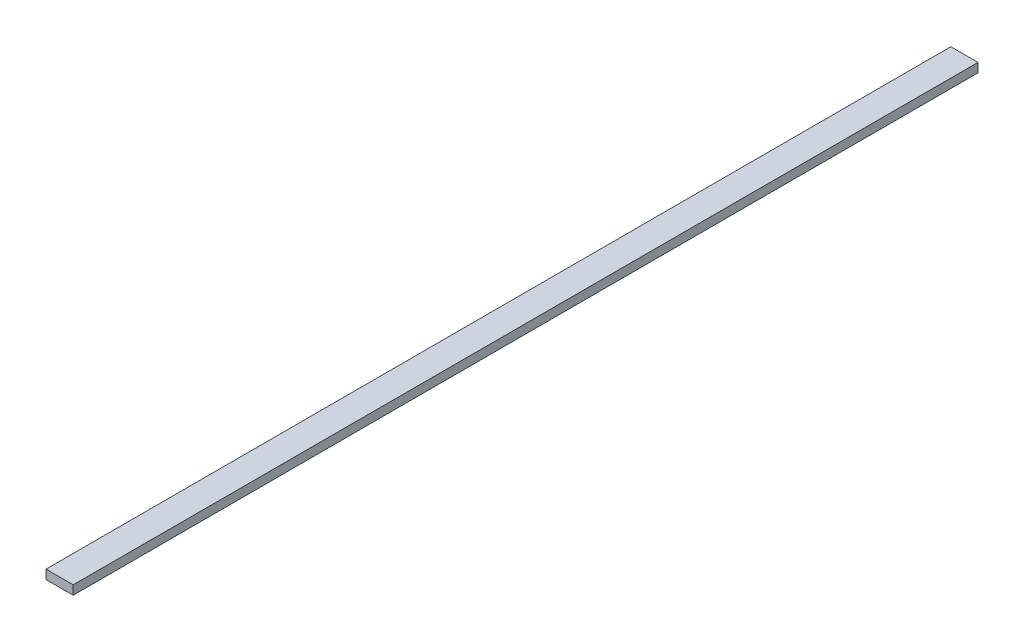
ISO-10303-21;
HEADER;
FILE_DESCRIPTION(('STEP AP214'),'2;1');
FILE_NAME('part.step','',(''),(''),'','','');
FILE_SCHEMA(('AUTOMOTIVE_DESIGN { 1 0 10303 214 1 1 1 1 }'));
ENDSEC;
DATA;
#1=APPLICATION_CONTEXT('core data for automotive mechanical design processes');
#2=APPLICATION_PROTOCOL_DEFINITION('international standard','automotive_design',2000,#1);
#3=PRODUCT_CONTEXT('',#1,'mechanical');
#4=PRODUCT('Part','Part','',(#3));
#5=PRODUCT_RELATED_PRODUCT_CATEGORY('part','',(#4));
#6=PRODUCT_DEFINITION_FORMATION('','',#4);
#7=PRODUCT_DEFINITION_CONTEXT('part definition',#1,'design');
#8=PRODUCT_DEFINITION('design','',#6,#7);
#9=PRODUCT_DEFINITION_SHAPE('','',#8);
#10=(LENGTH_UNIT() NAMED_UNIT(*) SI_UNIT(.MILLI.,.METRE.));
#11=(NAMED_UNIT(*) PLANE_ANGLE_UNIT() SI_UNIT($,.RADIAN.));
#12=(NAMED_UNIT(*) SI_UNIT($,.STERADIAN.) SOLID_ANGLE_UNIT());
#13=UNCERTAINTY_MEASURE_WITH_UNIT(LENGTH_MEASURE(1.E-05),#10,'distance_accuracy_value','');
#14=(GEOMETRIC_REPRESENTATION_CONTEXT(3) GLOBAL_UNCERTAINTY_ASSIGNED_CONTEXT((#13)) GLOBAL_UNIT_ASSIGNED_CONTEXT((#10,
#11,#12)) REPRESENTATION_CONTEXT('',''));
#15=CARTESIAN_POINT('',(0.,0.,0.));
#16=DIRECTION('',(0.,0.,1.));
#17=DIRECTION('',(1.,0.,0.));
#18=AXIS2_PLACEMENT_3D('',#15,#16,#17);
#19=CARTESIAN_POINT('',(-150.000000000001,100.,-5000.));
#20=DIRECTION('',(1.,0.,0.));
#21=DIRECTION('',(0.,0.,-1.));
#22=AXIS2_PLACEMENT_3D('',#19,#20,#21);
#23=PLANE('',#22);
#24=DIRECTION('',(0.,0.,1.));
#25=VECTOR('',#24,1.);
#26=CARTESIAN_POINT('',(-150.000000000001,0.,-5000.));
#27=LINE('',#26,#25);
#28=CARTESIAN_POINT('',(-150.000000000001,0.,-5000.));
#29=VERTEX_POINT('',#28);
#30=CARTESIAN_POINT('',(-150.,0.,5000.));
#31=VERTEX_POINT('',#30);
#32=EDGE_CURVE('E96',#29,#31,#27,.T.);
#33=ORIENTED_EDGE('',*,*,#32,.T.);
#34=DIRECTION('',(0.,-1.,0.));
#35=VECTOR('',#34,1.);
#36=CARTESIAN_POINT('',(-150.,100.,5000.));
#37=LINE('',#36,#35);
#38=CARTESIAN_POINT('',(-150.,100.,5000.));
#39=VERTEX_POINT('',#38);
#40=EDGE_CURVE('E11',#39,#31,#37,.T.);
#41=ORIENTED_EDGE('',*,*,#40,.F.);
#42=DIRECTION('',(0.,0.,1.));
#43=VECTOR('',#42,1.);
#44=CARTESIAN_POINT('',(-150.000000000001,100.,-5000.));
#45=LINE('',#44,#43);
#46=CARTESIAN_POINT('',(-150.000000000001,100.,-5000.));
#47=VERTEX_POINT('',#46);
#48=EDGE_CURVE('E84',#47,#39,#45,.T.);
#49=ORIENTED_EDGE('',*,*,#48,.F.);
#50=DIRECTION('',(0.,-1.,0.));
#51=VECTOR('',#50,1.);
#52=CARTESIAN_POINT('',(-150.000000000001,100.,-5000.));
#53=LINE('',#52,#51);
#54=EDGE_CURVE('E92',#47,#29,#53,.T.);
#55=ORIENTED_EDGE('',*,*,#54,.T.);
#56=EDGE_LOOP('',(#33,#41,#49,#55));
#57=FACE_BOUND('',#56,.T.);
#58=ADVANCED_FACE('F33',(#57),#23,.F.);
#59=CARTESIAN_POINT('',(-150.,100.,5000.));
#60=DIRECTION('',(0.,0.,-1.));
#61=DIRECTION('',(-1.,0.,0.));
#62=AXIS2_PLACEMENT_3D('',#59,#60,#61);
#63=PLANE('',#62);
#64=DIRECTION('',(1.,0.,0.));
#65=VECTOR('',#64,1.);
#66=CARTESIAN_POINT('',(-150.,0.,5000.));
#67=LINE('',#66,#65);
#68=CARTESIAN_POINT('',(150.,0.,5000.));
#69=VERTEX_POINT('',#68);
#70=EDGE_CURVE('E88',#31,#69,#67,.T.);
#71=ORIENTED_EDGE('',*,*,#70,.T.);
#72=DIRECTION('',(0.,-1.,0.));
#73=VECTOR('',#72,1.);
#74=CARTESIAN_POINT('',(150.,100.,5000.));
#75=LINE('',#74,#73);
#76=CARTESIAN_POINT('',(150.,100.,5000.));
#77=VERTEX_POINT('',#76);
#78=EDGE_CURVE('E41',#77,#69,#75,.T.);
#79=ORIENTED_EDGE('',*,*,#78,.F.);
#80=DIRECTION('',(1.,0.,0.));
#81=VECTOR('',#80,1.);
#82=CARTESIAN_POINT('',(-150.,100.,5000.));
#83=LINE('',#82,#81);
#84=EDGE_CURVE('E79',#39,#77,#83,.T.);
#85=ORIENTED_EDGE('',*,*,#84,.F.);
#86=ORIENTED_EDGE('',*,*,#40,.T.);
#87=EDGE_LOOP('',(#71,#79,#85,#86));
#88=FACE_BOUND('',#87,.T.);
#89=ADVANCED_FACE('F87',(#88),#63,.F.);
#90=CARTESIAN_POINT('',(149.999999999999,100.,-5000.));
#91=DIRECTION('',(-1.,0.,0.));
#92=DIRECTION('',(0.,0.,1.));
#93=AXIS2_PLACEMENT_3D('',#90,#91,#92);
#94=PLANE('',#93);
#95=DIRECTION('',(0.,0.,-1.));
#96=VECTOR('',#95,1.);
#97=CARTESIAN_POINT('',(149.999999999999,0.,-5000.));
#98=LINE('',#97,#96);
#99=CARTESIAN_POINT('',(149.999999999999,0.,-5000.));
#100=VERTEX_POINT('',#99);
#101=EDGE_CURVE('E66',#69,#100,#98,.T.);
#102=ORIENTED_EDGE('',*,*,#101,.T.);
#103=DIRECTION('',(0.,-1.,0.));
#104=VECTOR('',#103,1.);
#105=CARTESIAN_POINT('',(149.999999999999,100.,-5000.));
#106=LINE('',#105,#104);
#107=CARTESIAN_POINT('',(149.999999999999,100.,-5000.));
#108=VERTEX_POINT('',#107);
#109=EDGE_CURVE('E89',#108,#100,#106,.T.);
#110=ORIENTED_EDGE('',*,*,#109,.F.);
#111=DIRECTION('',(0.,0.,-1.));
#112=VECTOR('',#111,1.);
#113=CARTESIAN_POINT('',(149.999999999999,100.,-5000.));
#114=LINE('',#113,#112);
#115=EDGE_CURVE('E82',#77,#108,#114,.T.);
#116=ORIENTED_EDGE('',*,*,#115,.F.);
#117=ORIENTED_EDGE('',*,*,#78,.T.);
#118=EDGE_LOOP('',(#102,#110,#116,#117));
#119=FACE_BOUND('',#118,.T.);
#120=ADVANCED_FACE('F90',(#119),#94,.F.);
#121=CARTESIAN_POINT('',(-150.000000000001,100.,-5000.));
#122=DIRECTION('',(0.,0.,1.));
#123=DIRECTION('',(1.,0.,0.));
#124=AXIS2_PLACEMENT_3D('',#121,#122,#123);
#125=PLANE('',#124);
#126=DIRECTION('',(-1.,0.,0.));
#127=VECTOR('',#126,1.);
#128=CARTESIAN_POINT('',(-150.000000000001,0.,-5000.));
#129=LINE('',#128,#127);
#130=EDGE_CURVE('E72',#100,#29,#129,.T.);
#131=ORIENTED_EDGE('',*,*,#130,.T.);
#132=ORIENTED_EDGE('',*,*,#54,.F.);
#133=DIRECTION('',(-1.,0.,0.));
#134=VECTOR('',#133,1.);
#135=CARTESIAN_POINT('',(-150.000000000001,100.,-5000.));
#136=LINE('',#135,#134);
#137=EDGE_CURVE('E49',#108,#47,#136,.T.);
#138=ORIENTED_EDGE('',*,*,#137,.F.);
#139=ORIENTED_EDGE('',*,*,#109,.T.);
#140=EDGE_LOOP('',(#131,#132,#138,#139));
#141=FACE_BOUND('',#140,.T.);
#142=ADVANCED_FACE('F103',(#141),#125,.F.);
#143=CARTESIAN_POINT('',(0.,100.,0.));
#144=DIRECTION('',(0.,1.,0.));
#145=DIRECTION('',(0.,0.,1.));
#146=AXIS2_PLACEMENT_3D('',#143,#144,#145);
#147=PLANE('',#146);
#148=ORIENTED_EDGE('',*,*,#48,.T.);
#149=ORIENTED_EDGE('',*,*,#84,.T.);
#150=ORIENTED_EDGE('',*,*,#115,.T.);
#151=ORIENTED_EDGE('',*,*,#137,.T.);
#152=EDGE_LOOP('',(#148,#149,#150,#151));
#153=FACE_BOUND('',#152,.T.);
#154=ADVANCED_FACE('F80',(#153),#147,.T.);
#155=CARTESIAN_POINT('',(0.,0.,0.));
#156=DIRECTION('',(0.,1.,0.));
#157=DIRECTION('',(0.,0.,1.));
#158=AXIS2_PLACEMENT_3D('',#155,#156,#157);
#159=PLANE('',#158);
#160=ORIENTED_EDGE('',*,*,#32,.F.);
#161=ORIENTED_EDGE('',*,*,#130,.F.);
#162=ORIENTED_EDGE('',*,*,#101,.F.);
#163=ORIENTED_EDGE('',*,*,#70,.F.);
#164=EDGE_LOOP('',(#160,#161,#162,#163));
#165=FACE_BOUND('',#164,.T.);
#166=ADVANCED_FACE('F106',(#165),#159,.F.);
#167=CLOSED_SHELL('',(#58,#89,#120,#142,#154,#166));
#168=MANIFOLD_SOLID_BREP('B2',#167);
#169=ADVANCED_BREP_SHAPE_REPRESENTATION('',(#18,#168),#14);
#170=SHAPE_DEFINITION_REPRESENTATION(#9,#169);
ENDSEC;
END-ISO-10303-21;
